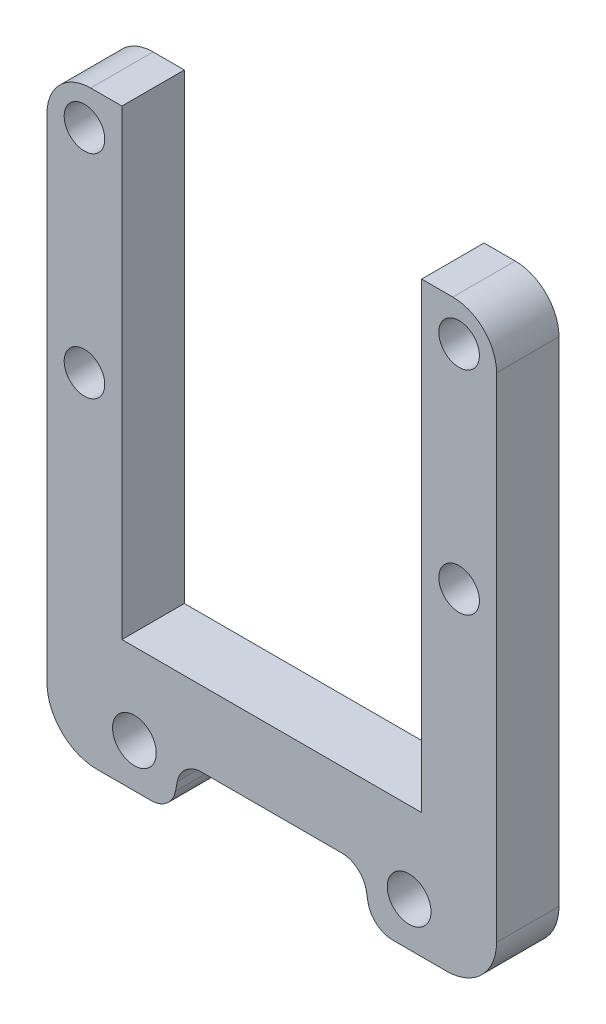
ISO-10303-21;
HEADER;
FILE_DESCRIPTION(('STEP AP214'),'2;1');
FILE_NAME('part.step','',(''),(''),'','','');
FILE_SCHEMA(('AUTOMOTIVE_DESIGN { 1 0 10303 214 1 1 1 1 }'));
ENDSEC;
DATA;
#1=APPLICATION_CONTEXT('core data for automotive mechanical design processes');
#2=APPLICATION_PROTOCOL_DEFINITION('international standard','automotive_design',2000,#1);
#3=PRODUCT_CONTEXT('',#1,'mechanical');
#4=PRODUCT('Part','Part','',(#3));
#5=PRODUCT_RELATED_PRODUCT_CATEGORY('part','',(#4));
#6=PRODUCT_DEFINITION_FORMATION('','',#4);
#7=PRODUCT_DEFINITION_CONTEXT('part definition',#1,'design');
#8=PRODUCT_DEFINITION('design','',#6,#7);
#9=PRODUCT_DEFINITION_SHAPE('','',#8);
#10=(LENGTH_UNIT() NAMED_UNIT(*) SI_UNIT(.MILLI.,.METRE.));
#11=(NAMED_UNIT(*) PLANE_ANGLE_UNIT() SI_UNIT($,.RADIAN.));
#12=(NAMED_UNIT(*) SI_UNIT($,.STERADIAN.) SOLID_ANGLE_UNIT());
#13=UNCERTAINTY_MEASURE_WITH_UNIT(LENGTH_MEASURE(1.E-05),#10,'distance_accuracy_value','');
#14=(GEOMETRIC_REPRESENTATION_CONTEXT(3) GLOBAL_UNCERTAINTY_ASSIGNED_CONTEXT((#13)) GLOBAL_UNIT_ASSIGNED_CONTEXT((#10,
#11,#12)) REPRESENTATION_CONTEXT('',''));
#15=CARTESIAN_POINT('',(0.,0.,0.));
#16=DIRECTION('',(0.,0.,1.));
#17=DIRECTION('',(1.,0.,0.));
#18=AXIS2_PLACEMENT_3D('',#15,#16,#17);
#19=CARTESIAN_POINT('',(0.,0.,10.));
#20=DIRECTION('',(0.,0.,1.));
#21=DIRECTION('',(1.,0.,0.));
#22=AXIS2_PLACEMENT_3D('',#19,#20,#21);
#23=PLANE('',#22);
#24=CARTESIAN_POINT('',(30.,104.,10.));
#25=DIRECTION('',(0.,0.,1.));
#26=DIRECTION('',(1.,0.,0.));
#27=AXIS2_PLACEMENT_3D('',#24,#25,#26);
#28=CIRCLE('',#27,3.24999999999999);
#29=CARTESIAN_POINT('',(33.25,104.,10.));
#30=VERTEX_POINT('',#29);
#31=EDGE_CURVE('E276',#30,#30,#28,.T.);
#32=ORIENTED_EDGE('',*,*,#31,.F.);
#33=EDGE_LOOP('',(#32));
#34=FACE_BOUND('',#33,.T.);
#35=DIRECTION('',(0.,1.,0.));
#36=VECTOR('',#35,1.);
#37=CARTESIAN_POINT('',(36.,16.,10.));
#38=LINE('',#37,#36);
#39=CARTESIAN_POINT('',(36.,24.,10.));
#40=VERTEX_POINT('',#39);
#41=CARTESIAN_POINT('',(36.,103.,10.));
#42=VERTEX_POINT('',#41);
#43=EDGE_CURVE('E312',#40,#42,#38,.T.);
#44=ORIENTED_EDGE('',*,*,#43,.T.);
#45=CARTESIAN_POINT('',(29.,103.,10.));
#46=DIRECTION('',(0.,0.,1.));
#47=DIRECTION('',(1.,0.,0.));
#48=AXIS2_PLACEMENT_3D('',#45,#46,#47);
#49=CIRCLE('',#48,7.);
#50=CARTESIAN_POINT('',(29.,110.,10.));
#51=VERTEX_POINT('',#50);
#52=EDGE_CURVE('E438',#42,#51,#49,.T.);
#53=ORIENTED_EDGE('',*,*,#52,.T.);
#54=DIRECTION('',(-1.,0.,0.));
#55=VECTOR('',#54,1.);
#56=CARTESIAN_POINT('',(36.,110.,10.));
#57=LINE('',#56,#55);
#58=CARTESIAN_POINT('',(24.,110.,10.));
#59=VERTEX_POINT('',#58);
#60=EDGE_CURVE('E292',#51,#59,#57,.T.);
#61=ORIENTED_EDGE('',*,*,#60,.T.);
#62=DIRECTION('',(0.,-1.,0.));
#63=VECTOR('',#62,1.);
#64=CARTESIAN_POINT('',(24.,110.,10.));
#65=LINE('',#64,#63);
#66=CARTESIAN_POINT('',(24.,36.,10.));
#67=VERTEX_POINT('',#66);
#68=EDGE_CURVE('E295',#59,#67,#65,.T.);
#69=ORIENTED_EDGE('',*,*,#68,.T.);
#70=DIRECTION('',(-1.,0.,0.));
#71=VECTOR('',#70,1.);
#72=CARTESIAN_POINT('',(24.,36.,10.));
#73=LINE('',#72,#71);
#74=CARTESIAN_POINT('',(-24.,36.,10.));
#75=VERTEX_POINT('',#74);
#76=EDGE_CURVE('E232',#67,#75,#73,.T.);
#77=ORIENTED_EDGE('',*,*,#76,.T.);
#78=DIRECTION('',(0.,-1.,0.));
#79=VECTOR('',#78,1.);
#80=CARTESIAN_POINT('',(-24.,110.,10.));
#81=LINE('',#80,#79);
#82=CARTESIAN_POINT('',(-24.,110.,10.));
#83=VERTEX_POINT('',#82);
#84=EDGE_CURVE('E217',#83,#75,#81,.T.);
#85=ORIENTED_EDGE('',*,*,#84,.F.);
#86=DIRECTION('',(1.,0.,0.));
#87=VECTOR('',#86,1.);
#88=CARTESIAN_POINT('',(-36.,110.,10.));
#89=LINE('',#88,#87);
#90=CARTESIAN_POINT('',(-29.,110.,10.));
#91=VERTEX_POINT('',#90);
#92=EDGE_CURVE('E211',#91,#83,#89,.T.);
#93=ORIENTED_EDGE('',*,*,#92,.F.);
#94=CARTESIAN_POINT('',(-29.,103.,10.));
#95=DIRECTION('',(0.,0.,1.));
#96=DIRECTION('',(1.,0.,0.));
#97=AXIS2_PLACEMENT_3D('',#94,#95,#96);
#98=CIRCLE('',#97,7.);
#99=CARTESIAN_POINT('',(-36.,103.,10.));
#100=VERTEX_POINT('',#99);
#101=EDGE_CURVE('E61',#91,#100,#98,.T.);
#102=ORIENTED_EDGE('',*,*,#101,.T.);
#103=DIRECTION('',(0.,1.,0.));
#104=VECTOR('',#103,1.);
#105=CARTESIAN_POINT('',(-36.,16.,10.));
#106=LINE('',#105,#104);
#107=CARTESIAN_POINT('',(-36.,24.,10.));
#108=VERTEX_POINT('',#107);
#109=EDGE_CURVE('E247',#108,#100,#106,.T.);
#110=ORIENTED_EDGE('',*,*,#109,.F.);
#111=CARTESIAN_POINT('',(-28.,24.,10.));
#112=DIRECTION('',(0.,0.,1.));
#113=DIRECTION('',(1.,0.,0.));
#114=AXIS2_PLACEMENT_3D('',#111,#112,#113);
#115=CIRCLE('',#114,8.);
#116=CARTESIAN_POINT('',(-28.,16.,10.));
#117=VERTEX_POINT('',#116);
#118=EDGE_CURVE('E414',#108,#117,#115,.T.);
#119=ORIENTED_EDGE('',*,*,#118,.T.);
#120=DIRECTION('',(-1.,0.,0.));
#121=VECTOR('',#120,1.);
#122=CARTESIAN_POINT('',(-16.0550424731017,16.,10.));
#123=LINE('',#122,#121);
#124=CARTESIAN_POINT('',(-19.3523880163717,16.,10.));
#125=VERTEX_POINT('',#124);
#126=EDGE_CURVE('E240',#125,#117,#123,.T.);
#127=ORIENTED_EDGE('',*,*,#126,.F.);
#128=CARTESIAN_POINT('',(-19.3523880163717,20.,10.));
#129=DIRECTION('',(0.,0.,1.));
#130=DIRECTION('',(1.,0.,0.));
#131=AXIS2_PLACEMENT_3D('',#128,#129,#130);
#132=CIRCLE('',#131,4.);
#133=CARTESIAN_POINT('',(-15.4258792825811,19.2367640184938,10.));
#134=VERTEX_POINT('',#133);
#135=EDGE_CURVE('E363',#125,#134,#132,.T.);
#136=ORIENTED_EDGE('',*,*,#135,.T.);
#137=DIRECTION('',(-0.190808995376542,-0.981627183447665,0.));
#138=VECTOR('',#137,1.);
#139=CARTESIAN_POINT('',(-14.5,24.,10.));
#140=LINE('',#139,#138);
#141=CARTESIAN_POINT('',(-15.1291631905207,20.7632359815062,10.));
#142=VERTEX_POINT('',#141);
#143=EDGE_CURVE('E235',#142,#134,#140,.T.);
#144=ORIENTED_EDGE('',*,*,#143,.F.);
#145=CARTESIAN_POINT('',(-11.20265445673,20.,10.));
#146=DIRECTION('',(0.,0.,1.));
#147=DIRECTION('',(1.,0.,0.));
#148=AXIS2_PLACEMENT_3D('',#145,#146,#147);
#149=CIRCLE('',#148,4.);
#150=CARTESIAN_POINT('',(-11.20265445673,24.,10.));
#151=VERTEX_POINT('',#150);
#152=EDGE_CURVE('E389',#142,#151,#149,.F.);
#153=ORIENTED_EDGE('',*,*,#152,.T.);
#154=DIRECTION('',(1.,0.,0.));
#155=VECTOR('',#154,1.);
#156=CARTESIAN_POINT('',(0.,24.,10.));
#157=LINE('',#156,#155);
#158=CARTESIAN_POINT('',(11.20265445673,24.,10.));
#159=VERTEX_POINT('',#158);
#160=EDGE_CURVE('E300',#151,#159,#157,.T.);
#161=ORIENTED_EDGE('',*,*,#160,.T.);
#162=CARTESIAN_POINT('',(11.20265445673,20.,10.));
#163=DIRECTION('',(0.,0.,1.));
#164=DIRECTION('',(1.,0.,0.));
#165=AXIS2_PLACEMENT_3D('',#162,#163,#164);
#166=CIRCLE('',#165,4.);
#167=CARTESIAN_POINT('',(15.1291631905207,20.7632359815062,10.));
#168=VERTEX_POINT('',#167);
#169=EDGE_CURVE('E395',#159,#168,#166,.F.);
#170=ORIENTED_EDGE('',*,*,#169,.T.);
#171=DIRECTION('',(0.190808995376542,-0.981627183447665,0.));
#172=VECTOR('',#171,1.);
#173=CARTESIAN_POINT('',(14.5,24.,10.));
#174=LINE('',#173,#172);
#175=CARTESIAN_POINT('',(15.4258792825811,19.2367640184938,10.));
#176=VERTEX_POINT('',#175);
#177=EDGE_CURVE('E304',#168,#176,#174,.T.);
#178=ORIENTED_EDGE('',*,*,#177,.T.);
#179=CARTESIAN_POINT('',(19.3523880163717,20.,10.));
#180=DIRECTION('',(0.,0.,1.));
#181=DIRECTION('',(1.,0.,0.));
#182=AXIS2_PLACEMENT_3D('',#179,#180,#181);
#183=CIRCLE('',#182,4.);
#184=CARTESIAN_POINT('',(19.3523880163717,16.,10.));
#185=VERTEX_POINT('',#184);
#186=EDGE_CURVE('E366',#176,#185,#183,.T.);
#187=ORIENTED_EDGE('',*,*,#186,.T.);
#188=DIRECTION('',(1.,0.,0.));
#189=VECTOR('',#188,1.);
#190=CARTESIAN_POINT('',(16.0550424731017,16.,10.));
#191=LINE('',#190,#189);
#192=CARTESIAN_POINT('',(28.,16.,10.));
#193=VERTEX_POINT('',#192);
#194=EDGE_CURVE('E308',#185,#193,#191,.T.);
#195=ORIENTED_EDGE('',*,*,#194,.T.);
#196=CARTESIAN_POINT('',(28.,24.,10.));
#197=DIRECTION('',(0.,0.,1.));
#198=DIRECTION('',(1.,0.,0.));
#199=AXIS2_PLACEMENT_3D('',#196,#197,#198);
#200=CIRCLE('',#199,8.);
#201=EDGE_CURVE('E411',#193,#40,#200,.T.);
#202=ORIENTED_EDGE('',*,*,#201,.T.);
#203=EDGE_LOOP('',(#44,#53,#61,#69,#77,#85,#93,#102,#110,#119,#127,#136,#144,#153,#161,#170,
#178,#187,#195,#202));
#204=FACE_BOUND('',#203,.T.);
#205=CARTESIAN_POINT('',(22.,23.,10.));
#206=DIRECTION('',(0.,0.,1.));
#207=DIRECTION('',(1.,0.,0.));
#208=AXIS2_PLACEMENT_3D('',#205,#206,#207);
#209=CIRCLE('',#208,3.5);
#210=CARTESIAN_POINT('',(25.5,23.,10.));
#211=VERTEX_POINT('',#210);
#212=EDGE_CURVE('E284',#211,#211,#209,.T.);
#213=ORIENTED_EDGE('',*,*,#212,.F.);
#214=EDGE_LOOP('',(#213));
#215=FACE_BOUND('',#214,.T.);
#216=CARTESIAN_POINT('',(30.,70.,10.));
#217=DIRECTION('',(0.,0.,1.));
#218=DIRECTION('',(1.,0.,0.));
#219=AXIS2_PLACEMENT_3D('',#216,#217,#218);
#220=CIRCLE('',#219,3.24999999999999);
#221=CARTESIAN_POINT('',(33.25,70.,10.));
#222=VERTEX_POINT('',#221);
#223=EDGE_CURVE('E268',#222,#222,#220,.T.);
#224=ORIENTED_EDGE('',*,*,#223,.F.);
#225=EDGE_LOOP('',(#224));
#226=FACE_BOUND('',#225,.T.);
#227=CARTESIAN_POINT('',(-30.,104.,10.));
#228=DIRECTION('',(0.,0.,-1.));
#229=DIRECTION('',(-1.,0.,0.));
#230=AXIS2_PLACEMENT_3D('',#227,#228,#229);
#231=CIRCLE('',#230,3.24999999999999);
#232=CARTESIAN_POINT('',(-33.25,104.,10.));
#233=VERTEX_POINT('',#232);
#234=EDGE_CURVE('E711',#233,#233,#231,.T.);
#235=ORIENTED_EDGE('',*,*,#234,.T.);
#236=EDGE_LOOP('',(#235));
#237=FACE_BOUND('',#236,.T.);
#238=CARTESIAN_POINT('',(-22.,23.,10.));
#239=DIRECTION('',(0.,0.,-1.));
#240=DIRECTION('',(-1.,0.,0.));
#241=AXIS2_PLACEMENT_3D('',#238,#239,#240);
#242=CIRCLE('',#241,3.5);
#243=CARTESIAN_POINT('',(-25.5,23.,10.));
#244=VERTEX_POINT('',#243);
#245=EDGE_CURVE('E252',#244,#244,#242,.T.);
#246=ORIENTED_EDGE('',*,*,#245,.T.);
#247=EDGE_LOOP('',(#246));
#248=FACE_BOUND('',#247,.T.);
#249=CARTESIAN_POINT('',(-30.,70.,10.));
#250=DIRECTION('',(0.,0.,-1.));
#251=DIRECTION('',(-1.,0.,0.));
#252=AXIS2_PLACEMENT_3D('',#249,#250,#251);
#253=CIRCLE('',#252,3.24999999999999);
#254=CARTESIAN_POINT('',(-33.25,70.,10.));
#255=VERTEX_POINT('',#254);
#256=EDGE_CURVE('E700',#255,#255,#253,.T.);
#257=ORIENTED_EDGE('',*,*,#256,.T.);
#258=EDGE_LOOP('',(#257));
#259=FACE_BOUND('',#258,.T.);
#260=ADVANCED_FACE('F41',(#34,#204,#215,#226,#237,#248,#259),#23,.T.);
#261=CARTESIAN_POINT('',(0.,0.,0.));
#262=DIRECTION('',(0.,0.,1.));
#263=DIRECTION('',(1.,0.,0.));
#264=AXIS2_PLACEMENT_3D('',#261,#262,#263);
#265=PLANE('',#264);
#266=DIRECTION('',(-1.,0.,0.));
#267=VECTOR('',#266,1.);
#268=CARTESIAN_POINT('',(36.,110.,0.));
#269=LINE('',#268,#267);
#270=CARTESIAN_POINT('',(29.,110.,0.));
#271=VERTEX_POINT('',#270);
#272=CARTESIAN_POINT('',(24.,110.,0.));
#273=VERTEX_POINT('',#272);
#274=EDGE_CURVE('E288',#271,#273,#269,.T.);
#275=ORIENTED_EDGE('',*,*,#274,.F.);
#276=CARTESIAN_POINT('',(29.,103.,0.));
#277=DIRECTION('',(0.,0.,1.));
#278=DIRECTION('',(1.,0.,0.));
#279=AXIS2_PLACEMENT_3D('',#276,#277,#278);
#280=CIRCLE('',#279,7.);
#281=CARTESIAN_POINT('',(36.,103.,0.));
#282=VERTEX_POINT('',#281);
#283=EDGE_CURVE('E431',#271,#282,#280,.F.);
#284=ORIENTED_EDGE('',*,*,#283,.T.);
#285=DIRECTION('',(0.,1.,0.));
#286=VECTOR('',#285,1.);
#287=CARTESIAN_POINT('',(36.,16.,0.));
#288=LINE('',#287,#286);
#289=CARTESIAN_POINT('',(36.,24.,0.));
#290=VERTEX_POINT('',#289);
#291=EDGE_CURVE('E296',#290,#282,#288,.T.);
#292=ORIENTED_EDGE('',*,*,#291,.F.);
#293=CARTESIAN_POINT('',(28.,24.,0.));
#294=DIRECTION('',(0.,0.,1.));
#295=DIRECTION('',(1.,0.,0.));
#296=AXIS2_PLACEMENT_3D('',#293,#294,#295);
#297=CIRCLE('',#296,8.);
#298=CARTESIAN_POINT('',(28.,16.,0.));
#299=VERTEX_POINT('',#298);
#300=EDGE_CURVE('E402',#290,#299,#297,.F.);
#301=ORIENTED_EDGE('',*,*,#300,.T.);
#302=DIRECTION('',(1.,0.,0.));
#303=VECTOR('',#302,1.);
#304=CARTESIAN_POINT('',(16.0550424731017,16.,0.));
#305=LINE('',#304,#303);
#306=CARTESIAN_POINT('',(19.3523880163717,16.,0.));
#307=VERTEX_POINT('',#306);
#308=EDGE_CURVE('E332',#307,#299,#305,.T.);
#309=ORIENTED_EDGE('',*,*,#308,.F.);
#310=CARTESIAN_POINT('',(19.3523880163717,20.,0.));
#311=DIRECTION('',(0.,0.,1.));
#312=DIRECTION('',(1.,0.,0.));
#313=AXIS2_PLACEMENT_3D('',#310,#311,#312);
#314=CIRCLE('',#313,4.);
#315=CARTESIAN_POINT('',(15.4258792825811,19.2367640184938,0.));
#316=VERTEX_POINT('',#315);
#317=EDGE_CURVE('E353',#307,#316,#314,.F.);
#318=ORIENTED_EDGE('',*,*,#317,.T.);
#319=DIRECTION('',(0.190808995376542,-0.981627183447665,0.));
#320=VECTOR('',#319,1.);
#321=CARTESIAN_POINT('',(14.5,24.,0.));
#322=LINE('',#321,#320);
#323=CARTESIAN_POINT('',(15.1291631905207,20.7632359815062,0.));
#324=VERTEX_POINT('',#323);
#325=EDGE_CURVE('E328',#324,#316,#322,.T.);
#326=ORIENTED_EDGE('',*,*,#325,.F.);
#327=CARTESIAN_POINT('',(11.20265445673,20.,0.));
#328=DIRECTION('',(0.,0.,1.));
#329=DIRECTION('',(1.,0.,0.));
#330=AXIS2_PLACEMENT_3D('',#327,#328,#329);
#331=CIRCLE('',#330,4.);
#332=CARTESIAN_POINT('',(11.20265445673,24.,0.));
#333=VERTEX_POINT('',#332);
#334=EDGE_CURVE('E392',#324,#333,#331,.T.);
#335=ORIENTED_EDGE('',*,*,#334,.T.);
#336=DIRECTION('',(1.,0.,0.));
#337=VECTOR('',#336,1.);
#338=CARTESIAN_POINT('',(0.,24.,0.));
#339=LINE('',#338,#337);
#340=CARTESIAN_POINT('',(-11.20265445673,24.,0.));
#341=VERTEX_POINT('',#340);
#342=EDGE_CURVE('E324',#341,#333,#339,.T.);
#343=ORIENTED_EDGE('',*,*,#342,.F.);
#344=CARTESIAN_POINT('',(-11.20265445673,20.,0.));
#345=DIRECTION('',(0.,0.,1.));
#346=DIRECTION('',(1.,0.,0.));
#347=AXIS2_PLACEMENT_3D('',#344,#345,#346);
#348=CIRCLE('',#347,4.);
#349=CARTESIAN_POINT('',(-15.1291631905207,20.7632359815062,0.));
#350=VERTEX_POINT('',#349);
#351=EDGE_CURVE('E386',#341,#350,#348,.T.);
#352=ORIENTED_EDGE('',*,*,#351,.T.);
#353=DIRECTION('',(-0.190808995376542,-0.981627183447665,0.));
#354=VECTOR('',#353,1.);
#355=CARTESIAN_POINT('',(-14.5,24.,0.));
#356=LINE('',#355,#354);
#357=CARTESIAN_POINT('',(-15.4258792825811,19.2367640184938,0.));
#358=VERTEX_POINT('',#357);
#359=EDGE_CURVE('E255',#350,#358,#356,.T.);
#360=ORIENTED_EDGE('',*,*,#359,.T.);
#361=CARTESIAN_POINT('',(-19.3523880163717,20.,0.));
#362=DIRECTION('',(0.,0.,1.));
#363=DIRECTION('',(1.,0.,0.));
#364=AXIS2_PLACEMENT_3D('',#361,#362,#363);
#365=CIRCLE('',#364,4.);
#366=CARTESIAN_POINT('',(-19.3523880163717,16.,0.));
#367=VERTEX_POINT('',#366);
#368=EDGE_CURVE('E350',#358,#367,#365,.F.);
#369=ORIENTED_EDGE('',*,*,#368,.T.);
#370=DIRECTION('',(-1.,0.,0.));
#371=VECTOR('',#370,1.);
#372=CARTESIAN_POINT('',(-16.0550424731017,16.,0.));
#373=LINE('',#372,#371);
#374=CARTESIAN_POINT('',(-28.,16.,0.));
#375=VERTEX_POINT('',#374);
#376=EDGE_CURVE('E259',#367,#375,#373,.T.);
#377=ORIENTED_EDGE('',*,*,#376,.T.);
#378=CARTESIAN_POINT('',(-28.,24.,0.));
#379=DIRECTION('',(0.,0.,1.));
#380=DIRECTION('',(1.,0.,0.));
#381=AXIS2_PLACEMENT_3D('',#378,#379,#380);
#382=CIRCLE('',#381,8.);
#383=CARTESIAN_POINT('',(-36.,24.,0.));
#384=VERTEX_POINT('',#383);
#385=EDGE_CURVE('E405',#375,#384,#382,.F.);
#386=ORIENTED_EDGE('',*,*,#385,.T.);
#387=DIRECTION('',(0.,1.,0.));
#388=VECTOR('',#387,1.);
#389=CARTESIAN_POINT('',(-36.,16.,0.));
#390=LINE('',#389,#388);
#391=CARTESIAN_POINT('',(-36.,103.,0.));
#392=VERTEX_POINT('',#391);
#393=EDGE_CURVE('E218',#384,#392,#390,.T.);
#394=ORIENTED_EDGE('',*,*,#393,.T.);
#395=CARTESIAN_POINT('',(-29.,103.,0.));
#396=DIRECTION('',(0.,0.,1.));
#397=DIRECTION('',(1.,0.,0.));
#398=AXIS2_PLACEMENT_3D('',#395,#396,#397);
#399=CIRCLE('',#398,7.);
#400=CARTESIAN_POINT('',(-29.,110.,0.));
#401=VERTEX_POINT('',#400);
#402=EDGE_CURVE('E428',#392,#401,#399,.F.);
#403=ORIENTED_EDGE('',*,*,#402,.T.);
#404=DIRECTION('',(1.,0.,0.));
#405=VECTOR('',#404,1.);
#406=CARTESIAN_POINT('',(-36.,110.,0.));
#407=LINE('',#406,#405);
#408=CARTESIAN_POINT('',(-24.,110.,0.));
#409=VERTEX_POINT('',#408);
#410=EDGE_CURVE('E250',#401,#409,#407,.T.);
#411=ORIENTED_EDGE('',*,*,#410,.T.);
#412=DIRECTION('',(0.,-1.,0.));
#413=VECTOR('',#412,1.);
#414=CARTESIAN_POINT('',(-24.,110.,0.));
#415=LINE('',#414,#413);
#416=CARTESIAN_POINT('',(-24.,36.,0.));
#417=VERTEX_POINT('',#416);
#418=EDGE_CURVE('E225',#409,#417,#415,.T.);
#419=ORIENTED_EDGE('',*,*,#418,.T.);
#420=DIRECTION('',(-1.,0.,0.));
#421=VECTOR('',#420,1.);
#422=CARTESIAN_POINT('',(24.,36.,0.));
#423=LINE('',#422,#421);
#424=CARTESIAN_POINT('',(24.,36.,0.));
#425=VERTEX_POINT('',#424);
#426=EDGE_CURVE('E321',#425,#417,#423,.T.);
#427=ORIENTED_EDGE('',*,*,#426,.F.);
#428=DIRECTION('',(0.,-1.,0.));
#429=VECTOR('',#428,1.);
#430=CARTESIAN_POINT('',(24.,110.,0.));
#431=LINE('',#430,#429);
#432=EDGE_CURVE('E318',#273,#425,#431,.T.);
#433=ORIENTED_EDGE('',*,*,#432,.F.);
#434=EDGE_LOOP('',(#275,#284,#292,#301,#309,#318,#326,#335,#343,#352,#360,#369,#377,#386,#394,
#403,#411,#419,#427,#433));
#435=FACE_BOUND('',#434,.T.);
#436=CARTESIAN_POINT('',(22.,23.,0.));
#437=DIRECTION('',(0.,0.,1.));
#438=DIRECTION('',(1.,0.,0.));
#439=AXIS2_PLACEMENT_3D('',#436,#437,#438);
#440=CIRCLE('',#439,3.5);
#441=CARTESIAN_POINT('',(25.5,23.,0.));
#442=VERTEX_POINT('',#441);
#443=EDGE_CURVE('E280',#442,#442,#440,.T.);
#444=ORIENTED_EDGE('',*,*,#443,.T.);
#445=EDGE_LOOP('',(#444));
#446=FACE_BOUND('',#445,.T.);
#447=CARTESIAN_POINT('',(30.,104.,0.));
#448=DIRECTION('',(0.,0.,1.));
#449=DIRECTION('',(1.,0.,0.));
#450=AXIS2_PLACEMENT_3D('',#447,#448,#449);
#451=CIRCLE('',#450,3.24999999999999);
#452=CARTESIAN_POINT('',(33.25,104.,0.));
#453=VERTEX_POINT('',#452);
#454=EDGE_CURVE('E272',#453,#453,#451,.T.);
#455=ORIENTED_EDGE('',*,*,#454,.T.);
#456=EDGE_LOOP('',(#455));
#457=FACE_BOUND('',#456,.T.);
#458=CARTESIAN_POINT('',(30.,70.,0.));
#459=DIRECTION('',(0.,0.,1.));
#460=DIRECTION('',(1.,0.,0.));
#461=AXIS2_PLACEMENT_3D('',#458,#459,#460);
#462=CIRCLE('',#461,3.24999999999999);
#463=CARTESIAN_POINT('',(33.25,70.,0.));
#464=VERTEX_POINT('',#463);
#465=EDGE_CURVE('E226',#464,#464,#462,.T.);
#466=ORIENTED_EDGE('',*,*,#465,.T.);
#467=EDGE_LOOP('',(#466));
#468=FACE_BOUND('',#467,.T.);
#469=CARTESIAN_POINT('',(-22.,23.,0.));
#470=DIRECTION('',(0.,0.,-1.));
#471=DIRECTION('',(-1.,0.,0.));
#472=AXIS2_PLACEMENT_3D('',#469,#470,#471);
#473=CIRCLE('',#472,3.5);
#474=CARTESIAN_POINT('',(-25.5,23.,0.));
#475=VERTEX_POINT('',#474);
#476=EDGE_CURVE('E715',#475,#475,#473,.T.);
#477=ORIENTED_EDGE('',*,*,#476,.F.);
#478=EDGE_LOOP('',(#477));
#479=FACE_BOUND('',#478,.T.);
#480=CARTESIAN_POINT('',(-30.,104.,0.));
#481=DIRECTION('',(0.,0.,-1.));
#482=DIRECTION('',(-1.,0.,0.));
#483=AXIS2_PLACEMENT_3D('',#480,#481,#482);
#484=CIRCLE('',#483,3.24999999999999);
#485=CARTESIAN_POINT('',(-33.25,104.,0.));
#486=VERTEX_POINT('',#485);
#487=EDGE_CURVE('E708',#486,#486,#484,.T.);
#488=ORIENTED_EDGE('',*,*,#487,.F.);
#489=EDGE_LOOP('',(#488));
#490=FACE_BOUND('',#489,.T.);
#491=CARTESIAN_POINT('',(-30.,70.,0.));
#492=DIRECTION('',(0.,0.,-1.));
#493=DIRECTION('',(-1.,0.,0.));
#494=AXIS2_PLACEMENT_3D('',#491,#492,#493);
#495=CIRCLE('',#494,3.24999999999999);
#496=CARTESIAN_POINT('',(-33.25,70.,0.));
#497=VERTEX_POINT('',#496);
#498=EDGE_CURVE('E703',#497,#497,#495,.T.);
#499=ORIENTED_EDGE('',*,*,#498,.F.);
#500=EDGE_LOOP('',(#499));
#501=FACE_BOUND('',#500,.T.);
#502=ADVANCED_FACE('F451',(#435,#446,#457,#468,#479,#490,#501),#265,.F.);
#503=CARTESIAN_POINT('',(36.,110.,10.));
#504=DIRECTION('',(0.,-1.,0.));
#505=DIRECTION('',(0.,0.,-1.));
#506=AXIS2_PLACEMENT_3D('',#503,#504,#505);
#507=PLANE('',#506);
#508=ORIENTED_EDGE('',*,*,#60,.F.);
#509=DIRECTION('',(0.,0.,-1.));
#510=VECTOR('',#509,1.);
#511=CARTESIAN_POINT('',(29.,110.,10.));
#512=LINE('',#511,#510);
#513=EDGE_CURVE('E424',#51,#271,#512,.T.);
#514=ORIENTED_EDGE('',*,*,#513,.T.);
#515=ORIENTED_EDGE('',*,*,#274,.T.);
#516=DIRECTION('',(0.,0.,-1.));
#517=VECTOR('',#516,1.);
#518=CARTESIAN_POINT('',(24.,110.,10.));
#519=LINE('',#518,#517);
#520=EDGE_CURVE('E342',#59,#273,#519,.T.);
#521=ORIENTED_EDGE('',*,*,#520,.F.);
#522=EDGE_LOOP('',(#508,#514,#515,#521));
#523=FACE_BOUND('',#522,.T.);
#524=ADVANCED_FACE('F514',(#523),#507,.F.);
#525=CARTESIAN_POINT('',(24.,110.,10.));
#526=DIRECTION('',(1.,0.,0.));
#527=DIRECTION('',(0.,1.,0.));
#528=AXIS2_PLACEMENT_3D('',#525,#526,#527);
#529=PLANE('',#528);
#530=ORIENTED_EDGE('',*,*,#432,.T.);
#531=DIRECTION('',(0.,0.,-1.));
#532=VECTOR('',#531,1.);
#533=CARTESIAN_POINT('',(24.,36.,10.));
#534=LINE('',#533,#532);
#535=EDGE_CURVE('E315',#67,#425,#534,.T.);
#536=ORIENTED_EDGE('',*,*,#535,.F.);
#537=ORIENTED_EDGE('',*,*,#68,.F.);
#538=ORIENTED_EDGE('',*,*,#520,.T.);
#539=EDGE_LOOP('',(#530,#536,#537,#538));
#540=FACE_BOUND('',#539,.T.);
#541=ADVANCED_FACE('F519',(#540),#529,.F.);
#542=CARTESIAN_POINT('',(24.,36.,10.));
#543=DIRECTION('',(0.,-1.,0.));
#544=DIRECTION('',(1.,0.,0.));
#545=AXIS2_PLACEMENT_3D('',#542,#543,#544);
#546=PLANE('',#545);
#547=ORIENTED_EDGE('',*,*,#426,.T.);
#548=DIRECTION('',(0.,0.,-1.));
#549=VECTOR('',#548,1.);
#550=CARTESIAN_POINT('',(-24.,36.,10.));
#551=LINE('',#550,#549);
#552=EDGE_CURVE('E227',#75,#417,#551,.T.);
#553=ORIENTED_EDGE('',*,*,#552,.F.);
#554=ORIENTED_EDGE('',*,*,#76,.F.);
#555=ORIENTED_EDGE('',*,*,#535,.T.);
#556=EDGE_LOOP('',(#547,#553,#554,#555));
#557=FACE_BOUND('',#556,.T.);
#558=ADVANCED_FACE('F522',(#557),#546,.F.);
#559=CARTESIAN_POINT('',(0.,24.,10.));
#560=DIRECTION('',(0.,1.,0.));
#561=DIRECTION('',(0.,0.,1.));
#562=AXIS2_PLACEMENT_3D('',#559,#560,#561);
#563=PLANE('',#562);
#564=ORIENTED_EDGE('',*,*,#160,.F.);
#565=DIRECTION('',(0.,0.,-1.));
#566=VECTOR('',#565,1.);
#567=CARTESIAN_POINT('',(-11.20265445673,24.,0.));
#568=LINE('',#567,#566);
#569=EDGE_CURVE('E382',#151,#341,#568,.T.);
#570=ORIENTED_EDGE('',*,*,#569,.T.);
#571=ORIENTED_EDGE('',*,*,#342,.T.);
#572=DIRECTION('',(0.,0.,-1.));
#573=VECTOR('',#572,1.);
#574=CARTESIAN_POINT('',(11.20265445673,24.,10.));
#575=LINE('',#574,#573);
#576=EDGE_CURVE('E379',#333,#159,#575,.F.);
#577=ORIENTED_EDGE('',*,*,#576,.T.);
#578=EDGE_LOOP('',(#564,#570,#571,#577));
#579=FACE_BOUND('',#578,.T.);
#580=ADVANCED_FACE('F478',(#579),#563,.F.);
#581=CARTESIAN_POINT('',(14.5,24.,10.));
#582=DIRECTION('',(0.981627183447665,0.190808995376542,0.));
#583=DIRECTION('',(-0.190808995376542,0.981627183447665,0.));
#584=AXIS2_PLACEMENT_3D('',#581,#582,#583);
#585=PLANE('',#584);
#586=ORIENTED_EDGE('',*,*,#325,.T.);
#587=DIRECTION('',(0.,0.,-1.));
#588=VECTOR('',#587,1.);
#589=CARTESIAN_POINT('',(15.4258792825811,19.2367640184938,10.));
#590=LINE('',#589,#588);
#591=EDGE_CURVE('E360',#316,#176,#590,.F.);
#592=ORIENTED_EDGE('',*,*,#591,.T.);
#593=ORIENTED_EDGE('',*,*,#177,.F.);
#594=DIRECTION('',(0.,0.,-1.));
#595=VECTOR('',#594,1.);
#596=CARTESIAN_POINT('',(15.1291631905207,20.7632359815062,0.));
#597=LINE('',#596,#595);
#598=EDGE_CURVE('E356',#168,#324,#597,.T.);
#599=ORIENTED_EDGE('',*,*,#598,.T.);
#600=EDGE_LOOP('',(#586,#592,#593,#599));
#601=FACE_BOUND('',#600,.T.);
#602=ADVANCED_FACE('F487',(#601),#585,.F.);
#603=CARTESIAN_POINT('',(16.0550424731017,16.,10.));
#604=DIRECTION('',(0.,1.,0.));
#605=DIRECTION('',(0.,0.,1.));
#606=AXIS2_PLACEMENT_3D('',#603,#604,#605);
#607=PLANE('',#606);
#608=ORIENTED_EDGE('',*,*,#308,.T.);
#609=DIRECTION('',(0.,0.,-1.));
#610=VECTOR('',#609,1.);
#611=CARTESIAN_POINT('',(28.,16.,10.));
#612=LINE('',#611,#610);
#613=EDGE_CURVE('E421',#299,#193,#612,.F.);
#614=ORIENTED_EDGE('',*,*,#613,.T.);
#615=ORIENTED_EDGE('',*,*,#194,.F.);
#616=DIRECTION('',(0.,0.,-1.));
#617=VECTOR('',#616,1.);
#618=CARTESIAN_POINT('',(19.3523880163717,16.,10.));
#619=LINE('',#618,#617);
#620=EDGE_CURVE('E346',#185,#307,#619,.T.);
#621=ORIENTED_EDGE('',*,*,#620,.T.);
#622=EDGE_LOOP('',(#608,#614,#615,#621));
#623=FACE_BOUND('',#622,.T.);
#624=ADVANCED_FACE('F496',(#623),#607,.F.);
#625=CARTESIAN_POINT('',(36.,16.,10.));
#626=DIRECTION('',(-1.,0.,0.));
#627=DIRECTION('',(0.,0.,1.));
#628=AXIS2_PLACEMENT_3D('',#625,#626,#627);
#629=PLANE('',#628);
#630=ORIENTED_EDGE('',*,*,#291,.T.);
#631=DIRECTION('',(0.,0.,-1.));
#632=VECTOR('',#631,1.);
#633=CARTESIAN_POINT('',(36.,103.,10.));
#634=LINE('',#633,#632);
#635=EDGE_CURVE('E434',#282,#42,#634,.F.);
#636=ORIENTED_EDGE('',*,*,#635,.T.);
#637=ORIENTED_EDGE('',*,*,#43,.F.);
#638=DIRECTION('',(0.,0.,-1.));
#639=VECTOR('',#638,1.);
#640=CARTESIAN_POINT('',(36.,24.,10.));
#641=LINE('',#640,#639);
#642=EDGE_CURVE('E417',#40,#290,#641,.T.);
#643=ORIENTED_EDGE('',*,*,#642,.T.);
#644=EDGE_LOOP('',(#630,#636,#637,#643));
#645=FACE_BOUND('',#644,.T.);
#646=ADVANCED_FACE('F505',(#645),#629,.F.);
#647=CARTESIAN_POINT('',(22.,23.,10.));
#648=DIRECTION('',(0.,0.,-1.));
#649=DIRECTION('',(-1.,0.,0.));
#650=AXIS2_PLACEMENT_3D('',#647,#648,#649);
#651=CYLINDRICAL_SURFACE('',#650,3.5);
#652=ORIENTED_EDGE('',*,*,#212,.T.);
#653=EDGE_LOOP('',(#652));
#654=FACE_BOUND('',#653,.T.);
#655=ORIENTED_EDGE('',*,*,#443,.F.);
#656=EDGE_LOOP('',(#655));
#657=FACE_BOUND('',#656,.T.);
#658=ADVANCED_FACE('F536',(#654,#657),#651,.F.);
#659=CARTESIAN_POINT('',(30.,104.,10.));
#660=DIRECTION('',(0.,0.,-1.));
#661=DIRECTION('',(-1.,0.,0.));
#662=AXIS2_PLACEMENT_3D('',#659,#660,#661);
#663=CYLINDRICAL_SURFACE('',#662,3.24999999999999);
#664=ORIENTED_EDGE('',*,*,#31,.T.);
#665=EDGE_LOOP('',(#664));
#666=FACE_BOUND('',#665,.T.);
#667=ORIENTED_EDGE('',*,*,#454,.F.);
#668=EDGE_LOOP('',(#667));
#669=FACE_BOUND('',#668,.T.);
#670=ADVANCED_FACE('F662',(#666,#669),#663,.F.);
#671=CARTESIAN_POINT('',(30.,70.,10.));
#672=DIRECTION('',(0.,0.,-1.));
#673=DIRECTION('',(-1.,0.,0.));
#674=AXIS2_PLACEMENT_3D('',#671,#672,#673);
#675=CYLINDRICAL_SURFACE('',#674,3.24999999999999);
#676=ORIENTED_EDGE('',*,*,#223,.T.);
#677=EDGE_LOOP('',(#676));
#678=FACE_BOUND('',#677,.T.);
#679=ORIENTED_EDGE('',*,*,#465,.F.);
#680=EDGE_LOOP('',(#679));
#681=FACE_BOUND('',#680,.T.);
#682=ADVANCED_FACE('F600',(#678,#681),#675,.F.);
#683=CARTESIAN_POINT('',(-36.,110.,10.));
#684=DIRECTION('',(0.,-1.,0.));
#685=DIRECTION('',(0.,0.,-1.));
#686=AXIS2_PLACEMENT_3D('',#683,#684,#685);
#687=PLANE('',#686);
#688=ORIENTED_EDGE('',*,*,#410,.F.);
#689=DIRECTION('',(0.,0.,-1.));
#690=VECTOR('',#689,1.);
#691=CARTESIAN_POINT('',(-29.,110.,10.));
#692=LINE('',#691,#690);
#693=EDGE_CURVE('E11',#401,#91,#692,.F.);
#694=ORIENTED_EDGE('',*,*,#693,.T.);
#695=ORIENTED_EDGE('',*,*,#92,.T.);
#696=DIRECTION('',(0.,0.,-1.));
#697=VECTOR('',#696,1.);
#698=CARTESIAN_POINT('',(-24.,110.,10.));
#699=LINE('',#698,#697);
#700=EDGE_CURVE('E214',#83,#409,#699,.T.);
#701=ORIENTED_EDGE('',*,*,#700,.T.);
#702=EDGE_LOOP('',(#688,#694,#695,#701));
#703=FACE_BOUND('',#702,.T.);
#704=ADVANCED_FACE('F213',(#703),#687,.F.);
#705=CARTESIAN_POINT('',(-24.,110.,10.));
#706=DIRECTION('',(-1.,0.,0.));
#707=DIRECTION('',(0.,1.,0.));
#708=AXIS2_PLACEMENT_3D('',#705,#706,#707);
#709=PLANE('',#708);
#710=ORIENTED_EDGE('',*,*,#418,.F.);
#711=ORIENTED_EDGE('',*,*,#700,.F.);
#712=ORIENTED_EDGE('',*,*,#84,.T.);
#713=ORIENTED_EDGE('',*,*,#552,.T.);
#714=EDGE_LOOP('',(#710,#711,#712,#713));
#715=FACE_BOUND('',#714,.T.);
#716=ADVANCED_FACE('F222',(#715),#709,.F.);
#717=CARTESIAN_POINT('',(-14.5,24.,10.));
#718=DIRECTION('',(-0.981627183447665,0.190808995376542,0.));
#719=DIRECTION('',(0.190808995376542,0.981627183447665,0.));
#720=AXIS2_PLACEMENT_3D('',#717,#718,#719);
#721=PLANE('',#720);
#722=ORIENTED_EDGE('',*,*,#143,.T.);
#723=DIRECTION('',(0.,0.,-1.));
#724=VECTOR('',#723,1.);
#725=CARTESIAN_POINT('',(-15.4258792825811,19.2367640184938,10.));
#726=LINE('',#725,#724);
#727=EDGE_CURVE('E372',#134,#358,#726,.T.);
#728=ORIENTED_EDGE('',*,*,#727,.T.);
#729=ORIENTED_EDGE('',*,*,#359,.F.);
#730=DIRECTION('',(0.,0.,-1.));
#731=VECTOR('',#730,1.);
#732=CARTESIAN_POINT('',(-15.1291631905207,20.7632359815062,10.));
#733=LINE('',#732,#731);
#734=EDGE_CURVE('E369',#350,#142,#733,.F.);
#735=ORIENTED_EDGE('',*,*,#734,.T.);
#736=EDGE_LOOP('',(#722,#728,#729,#735));
#737=FACE_BOUND('',#736,.T.);
#738=ADVANCED_FACE('F469',(#737),#721,.F.);
#739=CARTESIAN_POINT('',(-16.0550424731017,16.,10.));
#740=DIRECTION('',(0.,1.,0.));
#741=DIRECTION('',(0.,0.,1.));
#742=AXIS2_PLACEMENT_3D('',#739,#740,#741);
#743=PLANE('',#742);
#744=ORIENTED_EDGE('',*,*,#126,.T.);
#745=DIRECTION('',(0.,0.,-1.));
#746=VECTOR('',#745,1.);
#747=CARTESIAN_POINT('',(-28.,16.,10.));
#748=LINE('',#747,#746);
#749=EDGE_CURVE('E398',#117,#375,#748,.T.);
#750=ORIENTED_EDGE('',*,*,#749,.T.);
#751=ORIENTED_EDGE('',*,*,#376,.F.);
#752=DIRECTION('',(0.,0.,-1.));
#753=VECTOR('',#752,1.);
#754=CARTESIAN_POINT('',(-19.3523880163717,16.,10.));
#755=LINE('',#754,#753);
#756=EDGE_CURVE('E376',#367,#125,#755,.F.);
#757=ORIENTED_EDGE('',*,*,#756,.T.);
#758=EDGE_LOOP('',(#744,#750,#751,#757));
#759=FACE_BOUND('',#758,.T.);
#760=ADVANCED_FACE('F459',(#759),#743,.F.);
#761=CARTESIAN_POINT('',(-36.,16.,10.));
#762=DIRECTION('',(1.,0.,0.));
#763=DIRECTION('',(0.,0.,1.));
#764=AXIS2_PLACEMENT_3D('',#761,#762,#763);
#765=PLANE('',#764);
#766=ORIENTED_EDGE('',*,*,#109,.T.);
#767=DIRECTION('',(0.,0.,-1.));
#768=VECTOR('',#767,1.);
#769=CARTESIAN_POINT('',(-36.,103.,10.));
#770=LINE('',#769,#768);
#771=EDGE_CURVE('E49',#100,#392,#770,.T.);
#772=ORIENTED_EDGE('',*,*,#771,.T.);
#773=ORIENTED_EDGE('',*,*,#393,.F.);
#774=DIRECTION('',(0.,0.,-1.));
#775=VECTOR('',#774,1.);
#776=CARTESIAN_POINT('',(-36.,24.,10.));
#777=LINE('',#776,#775);
#778=EDGE_CURVE('E408',#384,#108,#777,.F.);
#779=ORIENTED_EDGE('',*,*,#778,.T.);
#780=EDGE_LOOP('',(#766,#772,#773,#779));
#781=FACE_BOUND('',#780,.T.);
#782=ADVANCED_FACE('F446',(#781),#765,.F.);
#783=CARTESIAN_POINT('',(-22.,23.,10.));
#784=DIRECTION('',(0.,0.,-1.));
#785=DIRECTION('',(1.,0.,0.));
#786=AXIS2_PLACEMENT_3D('',#783,#784,#785);
#787=CYLINDRICAL_SURFACE('',#786,3.5);
#788=ORIENTED_EDGE('',*,*,#245,.F.);
#789=EDGE_LOOP('',(#788));
#790=FACE_BOUND('',#789,.T.);
#791=ORIENTED_EDGE('',*,*,#476,.T.);
#792=EDGE_LOOP('',(#791));
#793=FACE_BOUND('',#792,.T.);
#794=ADVANCED_FACE('F588',(#790,#793),#787,.F.);
#795=CARTESIAN_POINT('',(-30.,104.,10.));
#796=DIRECTION('',(0.,0.,-1.));
#797=DIRECTION('',(1.,0.,0.));
#798=AXIS2_PLACEMENT_3D('',#795,#796,#797);
#799=CYLINDRICAL_SURFACE('',#798,3.24999999999999);
#800=ORIENTED_EDGE('',*,*,#234,.F.);
#801=EDGE_LOOP('',(#800));
#802=FACE_BOUND('',#801,.T.);
#803=ORIENTED_EDGE('',*,*,#487,.T.);
#804=EDGE_LOOP('',(#803));
#805=FACE_BOUND('',#804,.T.);
#806=ADVANCED_FACE('F689',(#802,#805),#799,.F.);
#807=CARTESIAN_POINT('',(-30.,70.,10.));
#808=DIRECTION('',(0.,0.,-1.));
#809=DIRECTION('',(1.,0.,0.));
#810=AXIS2_PLACEMENT_3D('',#807,#808,#809);
#811=CYLINDRICAL_SURFACE('',#810,3.24999999999999);
#812=ORIENTED_EDGE('',*,*,#256,.F.);
#813=EDGE_LOOP('',(#812));
#814=FACE_BOUND('',#813,.T.);
#815=ORIENTED_EDGE('',*,*,#498,.T.);
#816=EDGE_LOOP('',(#815));
#817=FACE_BOUND('',#816,.T.);
#818=ADVANCED_FACE('F555',(#814,#817),#811,.F.);
#819=CARTESIAN_POINT('',(19.3523880163717,20.,10.));
#820=DIRECTION('',(0.,0.,-1.));
#821=DIRECTION('',(-1.,0.,0.));
#822=AXIS2_PLACEMENT_3D('',#819,#820,#821);
#823=CYLINDRICAL_SURFACE('',#822,4.);
#824=ORIENTED_EDGE('',*,*,#186,.F.);
#825=ORIENTED_EDGE('',*,*,#591,.F.);
#826=ORIENTED_EDGE('',*,*,#317,.F.);
#827=ORIENTED_EDGE('',*,*,#620,.F.);
#828=EDGE_LOOP('',(#824,#825,#826,#827));
#829=FACE_BOUND('',#828,.T.);
#830=ADVANCED_FACE('F493',(#829),#823,.T.);
#831=CARTESIAN_POINT('',(-19.3523880163717,20.,10.));
#832=DIRECTION('',(0.,0.,-1.));
#833=DIRECTION('',(-1.,0.,0.));
#834=AXIS2_PLACEMENT_3D('',#831,#832,#833);
#835=CYLINDRICAL_SURFACE('',#834,4.);
#836=ORIENTED_EDGE('',*,*,#135,.F.);
#837=ORIENTED_EDGE('',*,*,#756,.F.);
#838=ORIENTED_EDGE('',*,*,#368,.F.);
#839=ORIENTED_EDGE('',*,*,#727,.F.);
#840=EDGE_LOOP('',(#836,#837,#838,#839));
#841=FACE_BOUND('',#840,.T.);
#842=ADVANCED_FACE('F466',(#841),#835,.T.);
#843=CARTESIAN_POINT('',(-11.20265445673,20.,10.));
#844=DIRECTION('',(0.,0.,1.));
#845=DIRECTION('',(1.,0.,0.));
#846=AXIS2_PLACEMENT_3D('',#843,#844,#845);
#847=CYLINDRICAL_SURFACE('',#846,4.);
#848=ORIENTED_EDGE('',*,*,#152,.F.);
#849=ORIENTED_EDGE('',*,*,#734,.F.);
#850=ORIENTED_EDGE('',*,*,#351,.F.);
#851=ORIENTED_EDGE('',*,*,#569,.F.);
#852=EDGE_LOOP('',(#848,#849,#850,#851));
#853=FACE_BOUND('',#852,.T.);
#854=ADVANCED_FACE('F475',(#853),#847,.F.);
#855=CARTESIAN_POINT('',(11.20265445673,20.,10.));
#856=DIRECTION('',(0.,0.,1.));
#857=DIRECTION('',(1.,0.,0.));
#858=AXIS2_PLACEMENT_3D('',#855,#856,#857);
#859=CYLINDRICAL_SURFACE('',#858,4.);
#860=ORIENTED_EDGE('',*,*,#169,.F.);
#861=ORIENTED_EDGE('',*,*,#576,.F.);
#862=ORIENTED_EDGE('',*,*,#334,.F.);
#863=ORIENTED_EDGE('',*,*,#598,.F.);
#864=EDGE_LOOP('',(#860,#861,#862,#863));
#865=FACE_BOUND('',#864,.T.);
#866=ADVANCED_FACE('F484',(#865),#859,.F.);
#867=CARTESIAN_POINT('',(-28.,24.,10.));
#868=DIRECTION('',(0.,0.,-1.));
#869=DIRECTION('',(-1.,0.,0.));
#870=AXIS2_PLACEMENT_3D('',#867,#868,#869);
#871=CYLINDRICAL_SURFACE('',#870,8.);
#872=ORIENTED_EDGE('',*,*,#118,.F.);
#873=ORIENTED_EDGE('',*,*,#778,.F.);
#874=ORIENTED_EDGE('',*,*,#385,.F.);
#875=ORIENTED_EDGE('',*,*,#749,.F.);
#876=EDGE_LOOP('',(#872,#873,#874,#875));
#877=FACE_BOUND('',#876,.T.);
#878=ADVANCED_FACE('F457',(#877),#871,.T.);
#879=CARTESIAN_POINT('',(28.,24.,10.));
#880=DIRECTION('',(0.,0.,-1.));
#881=DIRECTION('',(-1.,0.,0.));
#882=AXIS2_PLACEMENT_3D('',#879,#880,#881);
#883=CYLINDRICAL_SURFACE('',#882,8.);
#884=ORIENTED_EDGE('',*,*,#201,.F.);
#885=ORIENTED_EDGE('',*,*,#613,.F.);
#886=ORIENTED_EDGE('',*,*,#300,.F.);
#887=ORIENTED_EDGE('',*,*,#642,.F.);
#888=EDGE_LOOP('',(#884,#885,#886,#887));
#889=FACE_BOUND('',#888,.T.);
#890=ADVANCED_FACE('F502',(#889),#883,.T.);
#891=CARTESIAN_POINT('',(29.,103.,10.));
#892=DIRECTION('',(0.,0.,-1.));
#893=DIRECTION('',(-1.,0.,0.));
#894=AXIS2_PLACEMENT_3D('',#891,#892,#893);
#895=CYLINDRICAL_SURFACE('',#894,7.);
#896=ORIENTED_EDGE('',*,*,#52,.F.);
#897=ORIENTED_EDGE('',*,*,#635,.F.);
#898=ORIENTED_EDGE('',*,*,#283,.F.);
#899=ORIENTED_EDGE('',*,*,#513,.F.);
#900=EDGE_LOOP('',(#896,#897,#898,#899));
#901=FACE_BOUND('',#900,.T.);
#902=ADVANCED_FACE('F511',(#901),#895,.T.);
#903=CARTESIAN_POINT('',(-29.,103.,10.));
#904=DIRECTION('',(0.,0.,-1.));
#905=DIRECTION('',(-1.,0.,0.));
#906=AXIS2_PLACEMENT_3D('',#903,#904,#905);
#907=CYLINDRICAL_SURFACE('',#906,7.);
#908=ORIENTED_EDGE('',*,*,#101,.F.);
#909=ORIENTED_EDGE('',*,*,#693,.F.);
#910=ORIENTED_EDGE('',*,*,#402,.F.);
#911=ORIENTED_EDGE('',*,*,#771,.F.);
#912=EDGE_LOOP('',(#908,#909,#910,#911));
#913=FACE_BOUND('',#912,.T.);
#914=ADVANCED_FACE('F43',(#913),#907,.T.);
#915=CLOSED_SHELL('',(#260,#502,#524,#541,#558,#580,#602,#624,#646,#658,#670,#682,#704,#716,
#738,#760,#782,#794,#806,#818,#830,#842,#854,#866,#878,#890,#902,#914));
#916=MANIFOLD_SOLID_BREP('B2',#915);
#917=ADVANCED_BREP_SHAPE_REPRESENTATION('',(#18,#916),#14);
#918=SHAPE_DEFINITION_REPRESENTATION(#9,#917);
ENDSEC;
END-ISO-10303-21;
